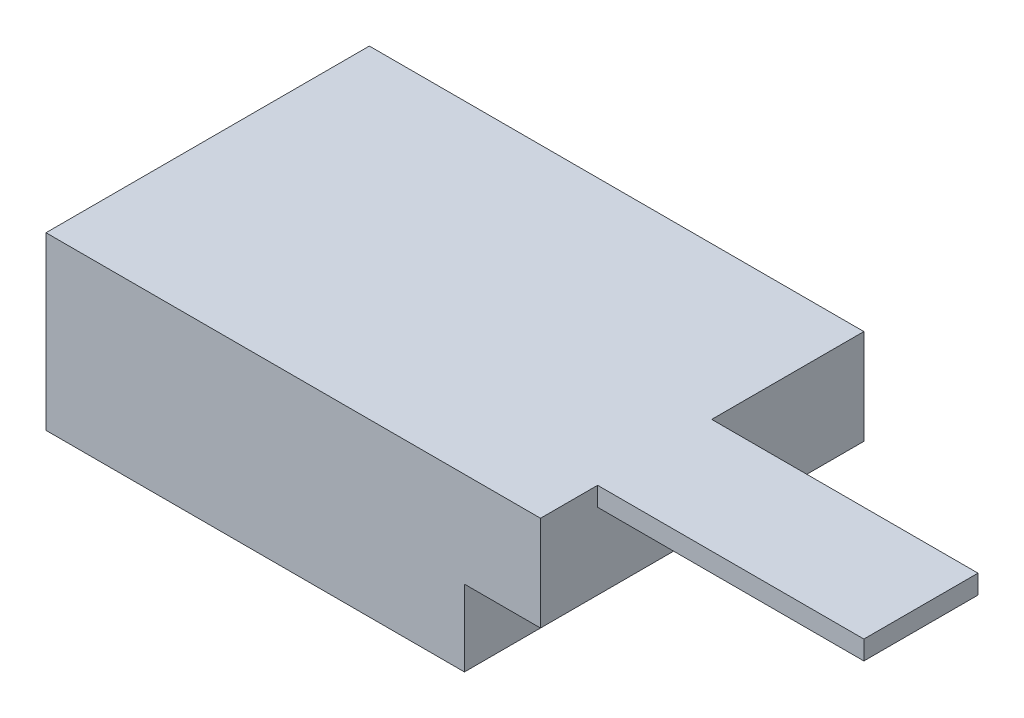
ISO-10303-21;
HEADER;
FILE_DESCRIPTION(('STEP AP214'),'2;1');
FILE_NAME('part.step','',(''),(''),'','','');
FILE_SCHEMA(('AUTOMOTIVE_DESIGN { 1 0 10303 214 1 1 1 1 }'));
ENDSEC;
DATA;
#1=APPLICATION_CONTEXT('core data for automotive mechanical design processes');
#2=APPLICATION_PROTOCOL_DEFINITION('international standard','automotive_design',2000,#1);
#3=PRODUCT_CONTEXT('',#1,'mechanical');
#4=PRODUCT('Part','Part','',(#3));
#5=PRODUCT_RELATED_PRODUCT_CATEGORY('part','',(#4));
#6=PRODUCT_DEFINITION_FORMATION('','',#4);
#7=PRODUCT_DEFINITION_CONTEXT('part definition',#1,'design');
#8=PRODUCT_DEFINITION('design','',#6,#7);
#9=PRODUCT_DEFINITION_SHAPE('','',#8);
#10=(LENGTH_UNIT() NAMED_UNIT(*) SI_UNIT(.MILLI.,.METRE.));
#11=(NAMED_UNIT(*) PLANE_ANGLE_UNIT() SI_UNIT($,.RADIAN.));
#12=(NAMED_UNIT(*) SI_UNIT($,.STERADIAN.) SOLID_ANGLE_UNIT());
#13=UNCERTAINTY_MEASURE_WITH_UNIT(LENGTH_MEASURE(1.E-05),#10,'distance_accuracy_value','');
#14=(GEOMETRIC_REPRESENTATION_CONTEXT(3) GLOBAL_UNCERTAINTY_ASSIGNED_CONTEXT((#13)) GLOBAL_UNIT_ASSIGNED_CONTEXT((#10,
#11,#12)) REPRESENTATION_CONTEXT('',''));
#15=CARTESIAN_POINT('',(0.,0.,0.));
#16=DIRECTION('',(0.,0.,1.));
#17=DIRECTION('',(1.,0.,0.));
#18=AXIS2_PLACEMENT_3D('',#15,#16,#17);
#19=CARTESIAN_POINT('',(41.275,28.575,26.9875));
#20=DIRECTION('',(-1.,0.,0.));
#21=DIRECTION('',(0.,0.,1.));
#22=AXIS2_PLACEMENT_3D('',#19,#20,#21);
#23=PLANE('',#22);
#24=DIRECTION('',(0.,1.,0.));
#25=VECTOR('',#24,1.);
#26=CARTESIAN_POINT('',(41.275,25.4,-1.5875));
#27=LINE('',#26,#25);
#28=CARTESIAN_POINT('',(41.275,25.4,-1.5875));
#29=VERTEX_POINT('',#28);
#30=CARTESIAN_POINT('',(41.275,28.575,-1.5875));
#31=VERTEX_POINT('',#30);
#32=EDGE_CURVE('E131',#29,#31,#27,.T.);
#33=ORIENTED_EDGE('',*,*,#32,.F.);
#34=DIRECTION('',(0.,0.,1.));
#35=VECTOR('',#34,1.);
#36=CARTESIAN_POINT('',(41.275,25.4,17.4625));
#37=LINE('',#36,#35);
#38=CARTESIAN_POINT('',(41.275,25.4,17.4625));
#39=VERTEX_POINT('',#38);
#40=EDGE_CURVE('E124',#29,#39,#37,.T.);
#41=ORIENTED_EDGE('',*,*,#40,.T.);
#42=DIRECTION('',(0.,1.,0.));
#43=VECTOR('',#42,1.);
#44=CARTESIAN_POINT('',(41.275,25.4,17.4625));
#45=LINE('',#44,#43);
#46=CARTESIAN_POINT('',(41.275,28.575,17.4625));
#47=VERTEX_POINT('',#46);
#48=EDGE_CURVE('E109',#39,#47,#45,.T.);
#49=ORIENTED_EDGE('',*,*,#48,.T.);
#50=DIRECTION('',(0.,0.,-1.));
#51=VECTOR('',#50,1.);
#52=CARTESIAN_POINT('',(41.275,28.575,26.9875));
#53=LINE('',#52,#51);
#54=CARTESIAN_POINT('',(41.275,28.575,26.9875));
#55=VERTEX_POINT('',#54);
#56=EDGE_CURVE('E177',#55,#47,#53,.T.);
#57=ORIENTED_EDGE('',*,*,#56,.F.);
#58=DIRECTION('',(0.,-1.,0.));
#59=VECTOR('',#58,1.);
#60=CARTESIAN_POINT('',(41.275,28.575,26.9875));
#61=LINE('',#60,#59);
#62=CARTESIAN_POINT('',(41.275,12.7,26.9875));
#63=VERTEX_POINT('',#62);
#64=EDGE_CURVE('E184',#55,#63,#61,.T.);
#65=ORIENTED_EDGE('',*,*,#64,.T.);
#66=DIRECTION('',(0.,0.,1.));
#67=VECTOR('',#66,1.);
#68=CARTESIAN_POINT('',(41.275,12.7,-26.9875));
#69=LINE('',#68,#67);
#70=CARTESIAN_POINT('',(41.275,12.7,-26.9875));
#71=VERTEX_POINT('',#70);
#72=EDGE_CURVE('E165',#71,#63,#69,.T.);
#73=ORIENTED_EDGE('',*,*,#72,.F.);
#74=DIRECTION('',(0.,-1.,0.));
#75=VECTOR('',#74,1.);
#76=CARTESIAN_POINT('',(41.275,28.575,-26.9875));
#77=LINE('',#76,#75);
#78=CARTESIAN_POINT('',(41.275,28.575,-26.9875));
#79=VERTEX_POINT('',#78);
#80=EDGE_CURVE('E11',#79,#71,#77,.T.);
#81=ORIENTED_EDGE('',*,*,#80,.F.);
#82=EDGE_CURVE('E175',#31,#79,#53,.T.);
#83=ORIENTED_EDGE('',*,*,#82,.F.);
#84=EDGE_LOOP('',(#33,#41,#49,#57,#65,#73,#81,#83));
#85=FACE_BOUND('',#84,.T.);
#86=ADVANCED_FACE('F33',(#85),#23,.F.);
#87=CARTESIAN_POINT('',(-41.275,28.575,-26.9875));
#88=DIRECTION('',(0.,0.,1.));
#89=DIRECTION('',(1.,0.,0.));
#90=AXIS2_PLACEMENT_3D('',#87,#88,#89);
#91=PLANE('',#90);
#92=DIRECTION('',(-1.,0.,0.));
#93=VECTOR('',#92,1.);
#94=CARTESIAN_POINT('',(28.575,12.7,-26.9875));
#95=LINE('',#94,#93);
#96=CARTESIAN_POINT('',(28.575,12.7,-26.9875));
#97=VERTEX_POINT('',#96);
#98=EDGE_CURVE('E160',#71,#97,#95,.T.);
#99=ORIENTED_EDGE('',*,*,#98,.T.);
#100=DIRECTION('',(0.,-1.,0.));
#101=VECTOR('',#100,1.);
#102=CARTESIAN_POINT('',(28.575,0.,-26.9875));
#103=LINE('',#102,#101);
#104=CARTESIAN_POINT('',(28.575,0.,-26.9875));
#105=VERTEX_POINT('',#104);
#106=EDGE_CURVE('E146',#97,#105,#103,.T.);
#107=ORIENTED_EDGE('',*,*,#106,.T.);
#108=DIRECTION('',(-1.,0.,0.));
#109=VECTOR('',#108,1.);
#110=CARTESIAN_POINT('',(-41.275,0.,-26.9875));
#111=LINE('',#110,#109);
#112=CARTESIAN_POINT('',(-41.275,0.,-26.9875));
#113=VERTEX_POINT('',#112);
#114=EDGE_CURVE('E164',#105,#113,#111,.T.);
#115=ORIENTED_EDGE('',*,*,#114,.T.);
#116=DIRECTION('',(0.,-1.,0.));
#117=VECTOR('',#116,1.);
#118=CARTESIAN_POINT('',(-41.275,28.575,-26.9875));
#119=LINE('',#118,#117);
#120=CARTESIAN_POINT('',(-41.275,28.575,-26.9875));
#121=VERTEX_POINT('',#120);
#122=EDGE_CURVE('E41',#121,#113,#119,.T.);
#123=ORIENTED_EDGE('',*,*,#122,.F.);
#124=DIRECTION('',(-1.,0.,0.));
#125=VECTOR('',#124,1.);
#126=CARTESIAN_POINT('',(-41.275,28.575,-26.9875));
#127=LINE('',#126,#125);
#128=EDGE_CURVE('E171',#79,#121,#127,.T.);
#129=ORIENTED_EDGE('',*,*,#128,.F.);
#130=ORIENTED_EDGE('',*,*,#80,.T.);
#131=EDGE_LOOP('',(#99,#107,#115,#123,#129,#130));
#132=FACE_BOUND('',#131,.T.);
#133=ADVANCED_FACE('F204',(#132),#91,.F.);
#134=CARTESIAN_POINT('',(-41.275,28.575,26.9875));
#135=DIRECTION('',(1.,0.,0.));
#136=DIRECTION('',(0.,0.,-1.));
#137=AXIS2_PLACEMENT_3D('',#134,#135,#136);
#138=PLANE('',#137);
#139=DIRECTION('',(0.,0.,1.));
#140=VECTOR('',#139,1.);
#141=CARTESIAN_POINT('',(-41.275,0.,26.9875));
#142=LINE('',#141,#140);
#143=CARTESIAN_POINT('',(-41.275,0.,26.9875));
#144=VERTEX_POINT('',#143);
#145=EDGE_CURVE('E191',#113,#144,#142,.T.);
#146=ORIENTED_EDGE('',*,*,#145,.T.);
#147=DIRECTION('',(0.,-1.,0.));
#148=VECTOR('',#147,1.);
#149=CARTESIAN_POINT('',(-41.275,28.575,26.9875));
#150=LINE('',#149,#148);
#151=CARTESIAN_POINT('',(-41.275,28.575,26.9875));
#152=VERTEX_POINT('',#151);
#153=EDGE_CURVE('E181',#152,#144,#150,.T.);
#154=ORIENTED_EDGE('',*,*,#153,.F.);
#155=DIRECTION('',(0.,0.,1.));
#156=VECTOR('',#155,1.);
#157=CARTESIAN_POINT('',(-41.275,28.575,26.9875));
#158=LINE('',#157,#156);
#159=EDGE_CURVE('E194',#121,#152,#158,.T.);
#160=ORIENTED_EDGE('',*,*,#159,.F.);
#161=ORIENTED_EDGE('',*,*,#122,.T.);
#162=EDGE_LOOP('',(#146,#154,#160,#161));
#163=FACE_BOUND('',#162,.T.);
#164=ADVANCED_FACE('F209',(#163),#138,.F.);
#165=CARTESIAN_POINT('',(-41.275,28.575,26.9875));
#166=DIRECTION('',(0.,0.,-1.));
#167=DIRECTION('',(-1.,0.,0.));
#168=AXIS2_PLACEMENT_3D('',#165,#166,#167);
#169=PLANE('',#168);
#170=DIRECTION('',(1.,0.,0.));
#171=VECTOR('',#170,1.);
#172=CARTESIAN_POINT('',(-41.275,0.,26.9875));
#173=LINE('',#172,#171);
#174=CARTESIAN_POINT('',(28.575,0.,26.9875));
#175=VERTEX_POINT('',#174);
#176=EDGE_CURVE('E188',#144,#175,#173,.T.);
#177=ORIENTED_EDGE('',*,*,#176,.T.);
#178=DIRECTION('',(0.,-1.,0.));
#179=VECTOR('',#178,1.);
#180=CARTESIAN_POINT('',(28.575,0.,26.9875));
#181=LINE('',#180,#179);
#182=CARTESIAN_POINT('',(28.575,12.7,26.9875));
#183=VERTEX_POINT('',#182);
#184=EDGE_CURVE('E57',#183,#175,#181,.T.);
#185=ORIENTED_EDGE('',*,*,#184,.F.);
#186=DIRECTION('',(-1.,0.,0.));
#187=VECTOR('',#186,1.);
#188=CARTESIAN_POINT('',(28.575,12.7,26.9875));
#189=LINE('',#188,#187);
#190=EDGE_CURVE('E156',#63,#183,#189,.T.);
#191=ORIENTED_EDGE('',*,*,#190,.F.);
#192=ORIENTED_EDGE('',*,*,#64,.F.);
#193=DIRECTION('',(1.,0.,0.));
#194=VECTOR('',#193,1.);
#195=CARTESIAN_POINT('',(-41.275,28.575,26.9875));
#196=LINE('',#195,#194);
#197=EDGE_CURVE('E187',#152,#55,#196,.T.);
#198=ORIENTED_EDGE('',*,*,#197,.F.);
#199=ORIENTED_EDGE('',*,*,#153,.T.);
#200=EDGE_LOOP('',(#177,#185,#191,#192,#198,#199));
#201=FACE_BOUND('',#200,.T.);
#202=ADVANCED_FACE('F214',(#201),#169,.F.);
#203=CARTESIAN_POINT('',(41.275,28.575,-26.9875));
#204=DIRECTION('',(0.,-1.,0.));
#205=DIRECTION('',(0.,0.,-1.));
#206=AXIS2_PLACEMENT_3D('',#203,#204,#205);
#207=PLANE('',#206);
#208=ORIENTED_EDGE('',*,*,#56,.T.);
#209=DIRECTION('',(1.,0.,0.));
#210=VECTOR('',#209,1.);
#211=CARTESIAN_POINT('',(41.275,28.575,17.4625));
#212=LINE('',#211,#210);
#213=CARTESIAN_POINT('',(85.725,28.575,17.4625));
#214=VERTEX_POINT('',#213);
#215=EDGE_CURVE('E49',#47,#214,#212,.T.);
#216=ORIENTED_EDGE('',*,*,#215,.T.);
#217=DIRECTION('',(0.,0.,-1.));
#218=VECTOR('',#217,1.);
#219=CARTESIAN_POINT('',(85.725,28.575,17.4625));
#220=LINE('',#219,#218);
#221=CARTESIAN_POINT('',(85.725,28.575,-1.5875));
#222=VERTEX_POINT('',#221);
#223=EDGE_CURVE('E135',#214,#222,#220,.T.);
#224=ORIENTED_EDGE('',*,*,#223,.T.);
#225=DIRECTION('',(-1.,0.,0.));
#226=VECTOR('',#225,1.);
#227=CARTESIAN_POINT('',(41.275,28.575,-1.5875));
#228=LINE('',#227,#226);
#229=EDGE_CURVE('E132',#222,#31,#228,.T.);
#230=ORIENTED_EDGE('',*,*,#229,.T.);
#231=ORIENTED_EDGE('',*,*,#82,.T.);
#232=ORIENTED_EDGE('',*,*,#128,.T.);
#233=ORIENTED_EDGE('',*,*,#159,.T.);
#234=ORIENTED_EDGE('',*,*,#197,.T.);
#235=EDGE_LOOP('',(#208,#216,#224,#230,#231,#232,#233,#234));
#236=FACE_BOUND('',#235,.T.);
#237=ADVANCED_FACE('F200',(#236),#207,.F.);
#238=CARTESIAN_POINT('',(41.275,0.,-26.9875));
#239=DIRECTION('',(0.,-1.,0.));
#240=DIRECTION('',(0.,0.,-1.));
#241=AXIS2_PLACEMENT_3D('',#238,#239,#240);
#242=PLANE('',#241);
#243=DIRECTION('',(0.,0.,1.));
#244=VECTOR('',#243,1.);
#245=CARTESIAN_POINT('',(28.575,0.,-26.9875));
#246=LINE('',#245,#244);
#247=EDGE_CURVE('E167',#105,#175,#246,.T.);
#248=ORIENTED_EDGE('',*,*,#247,.T.);
#249=ORIENTED_EDGE('',*,*,#176,.F.);
#250=ORIENTED_EDGE('',*,*,#145,.F.);
#251=ORIENTED_EDGE('',*,*,#114,.F.);
#252=EDGE_LOOP('',(#248,#249,#250,#251));
#253=FACE_BOUND('',#252,.T.);
#254=ADVANCED_FACE('F222',(#253),#242,.T.);
#255=CARTESIAN_POINT('',(28.575,0.,-26.9875));
#256=DIRECTION('',(-1.,0.,0.));
#257=DIRECTION('',(0.,0.,1.));
#258=AXIS2_PLACEMENT_3D('',#255,#256,#257);
#259=PLANE('',#258);
#260=ORIENTED_EDGE('',*,*,#184,.T.);
#261=ORIENTED_EDGE('',*,*,#247,.F.);
#262=ORIENTED_EDGE('',*,*,#106,.F.);
#263=DIRECTION('',(0.,0.,1.));
#264=VECTOR('',#263,1.);
#265=CARTESIAN_POINT('',(28.575,12.7,-26.9875));
#266=LINE('',#265,#264);
#267=EDGE_CURVE('E162',#97,#183,#266,.T.);
#268=ORIENTED_EDGE('',*,*,#267,.T.);
#269=EDGE_LOOP('',(#260,#261,#262,#268));
#270=FACE_BOUND('',#269,.T.);
#271=ADVANCED_FACE('F220',(#270),#259,.F.);
#272=CARTESIAN_POINT('',(28.575,12.7,-26.9875));
#273=DIRECTION('',(0.,1.,0.));
#274=DIRECTION('',(0.,0.,1.));
#275=AXIS2_PLACEMENT_3D('',#272,#273,#274);
#276=PLANE('',#275);
#277=ORIENTED_EDGE('',*,*,#190,.T.);
#278=ORIENTED_EDGE('',*,*,#267,.F.);
#279=ORIENTED_EDGE('',*,*,#98,.F.);
#280=ORIENTED_EDGE('',*,*,#72,.T.);
#281=EDGE_LOOP('',(#277,#278,#279,#280));
#282=FACE_BOUND('',#281,.T.);
#283=ADVANCED_FACE('F219',(#282),#276,.F.);
#284=CARTESIAN_POINT('',(41.275,25.4,-1.5875));
#285=DIRECTION('',(0.,0.,-1.));
#286=DIRECTION('',(-1.,0.,0.));
#287=AXIS2_PLACEMENT_3D('',#284,#285,#286);
#288=PLANE('',#287);
#289=ORIENTED_EDGE('',*,*,#229,.F.);
#290=DIRECTION('',(0.,1.,0.));
#291=VECTOR('',#290,1.);
#292=CARTESIAN_POINT('',(85.725,25.4,-1.5875));
#293=LINE('',#292,#291);
#294=CARTESIAN_POINT('',(85.725,25.4,-1.5875));
#295=VERTEX_POINT('',#294);
#296=EDGE_CURVE('E141',#295,#222,#293,.T.);
#297=ORIENTED_EDGE('',*,*,#296,.F.);
#298=DIRECTION('',(-1.,0.,0.));
#299=VECTOR('',#298,1.);
#300=CARTESIAN_POINT('',(41.275,25.4,-1.5875));
#301=LINE('',#300,#299);
#302=EDGE_CURVE('E118',#295,#29,#301,.T.);
#303=ORIENTED_EDGE('',*,*,#302,.T.);
#304=ORIENTED_EDGE('',*,*,#32,.T.);
#305=EDGE_LOOP('',(#289,#297,#303,#304));
#306=FACE_BOUND('',#305,.T.);
#307=ADVANCED_FACE('F273',(#306),#288,.T.);
#308=CARTESIAN_POINT('',(85.725,25.4,17.4625));
#309=DIRECTION('',(1.,0.,0.));
#310=DIRECTION('',(0.,0.,-1.));
#311=AXIS2_PLACEMENT_3D('',#308,#309,#310);
#312=PLANE('',#311);
#313=ORIENTED_EDGE('',*,*,#223,.F.);
#314=DIRECTION('',(0.,1.,0.));
#315=VECTOR('',#314,1.);
#316=CARTESIAN_POINT('',(85.725,25.4,17.4625));
#317=LINE('',#316,#315);
#318=CARTESIAN_POINT('',(85.725,25.4,17.4625));
#319=VERTEX_POINT('',#318);
#320=EDGE_CURVE('E117',#319,#214,#317,.T.);
#321=ORIENTED_EDGE('',*,*,#320,.F.);
#322=DIRECTION('',(0.,0.,-1.));
#323=VECTOR('',#322,1.);
#324=CARTESIAN_POINT('',(85.725,25.4,17.4625));
#325=LINE('',#324,#323);
#326=EDGE_CURVE('E127',#319,#295,#325,.T.);
#327=ORIENTED_EDGE('',*,*,#326,.T.);
#328=ORIENTED_EDGE('',*,*,#296,.T.);
#329=EDGE_LOOP('',(#313,#321,#327,#328));
#330=FACE_BOUND('',#329,.T.);
#331=ADVANCED_FACE('F278',(#330),#312,.T.);
#332=CARTESIAN_POINT('',(41.275,25.4,17.4625));
#333=DIRECTION('',(0.,0.,1.));
#334=DIRECTION('',(1.,0.,0.));
#335=AXIS2_PLACEMENT_3D('',#332,#333,#334);
#336=PLANE('',#335);
#337=ORIENTED_EDGE('',*,*,#215,.F.);
#338=ORIENTED_EDGE('',*,*,#48,.F.);
#339=DIRECTION('',(1.,0.,0.));
#340=VECTOR('',#339,1.);
#341=CARTESIAN_POINT('',(41.275,25.4,17.4625));
#342=LINE('',#341,#340);
#343=EDGE_CURVE('E112',#39,#319,#342,.T.);
#344=ORIENTED_EDGE('',*,*,#343,.T.);
#345=ORIENTED_EDGE('',*,*,#320,.T.);
#346=EDGE_LOOP('',(#337,#338,#344,#345));
#347=FACE_BOUND('',#346,.T.);
#348=ADVANCED_FACE('F111',(#347),#336,.T.);
#349=CARTESIAN_POINT('',(41.275,25.4,-1.5875));
#350=DIRECTION('',(0.,-1.,0.));
#351=DIRECTION('',(0.,0.,-1.));
#352=AXIS2_PLACEMENT_3D('',#349,#350,#351);
#353=PLANE('',#352);
#354=ORIENTED_EDGE('',*,*,#40,.F.);
#355=ORIENTED_EDGE('',*,*,#302,.F.);
#356=ORIENTED_EDGE('',*,*,#326,.F.);
#357=ORIENTED_EDGE('',*,*,#343,.F.);
#358=EDGE_LOOP('',(#354,#355,#356,#357));
#359=FACE_BOUND('',#358,.T.);
#360=ADVANCED_FACE('F122',(#359),#353,.T.);
#361=CLOSED_SHELL('',(#86,#133,#164,#202,#237,#254,#271,#283,#307,#331,#348,#360));
#362=MANIFOLD_SOLID_BREP('B2',#361);
#363=ADVANCED_BREP_SHAPE_REPRESENTATION('',(#18,#362),#14);
#364=SHAPE_DEFINITION_REPRESENTATION(#9,#363);
ENDSEC;
END-ISO-10303-21;
